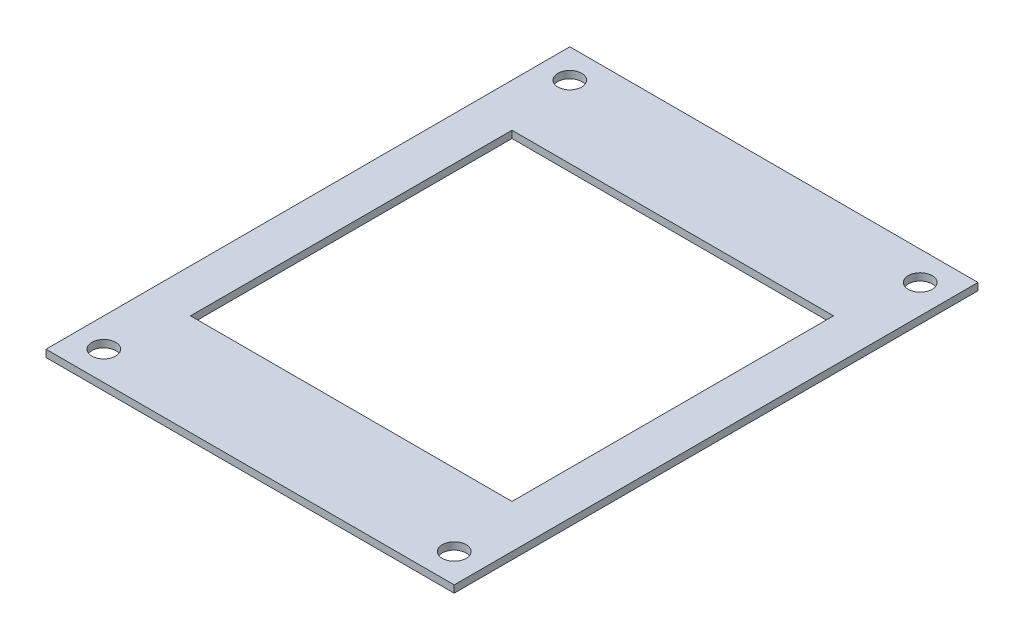
ISO-10303-21;
HEADER;
FILE_DESCRIPTION(('STEP AP214'),'2;1');
FILE_NAME('part.step','',(''),(''),'','','');
FILE_SCHEMA(('AUTOMOTIVE_DESIGN { 1 0 10303 214 1 1 1 1 }'));
ENDSEC;
DATA;
#1=APPLICATION_CONTEXT('core data for automotive mechanical design processes');
#2=APPLICATION_PROTOCOL_DEFINITION('international standard','automotive_design',2000,#1);
#3=PRODUCT_CONTEXT('',#1,'mechanical');
#4=PRODUCT('Part','Part','',(#3));
#5=PRODUCT_RELATED_PRODUCT_CATEGORY('part','',(#4));
#6=PRODUCT_DEFINITION_FORMATION('','',#4);
#7=PRODUCT_DEFINITION_CONTEXT('part definition',#1,'design');
#8=PRODUCT_DEFINITION('design','',#6,#7);
#9=PRODUCT_DEFINITION_SHAPE('','',#8);
#10=(LENGTH_UNIT() NAMED_UNIT(*) SI_UNIT(.MILLI.,.METRE.));
#11=(NAMED_UNIT(*) PLANE_ANGLE_UNIT() SI_UNIT($,.RADIAN.));
#12=(NAMED_UNIT(*) SI_UNIT($,.STERADIAN.) SOLID_ANGLE_UNIT());
#13=UNCERTAINTY_MEASURE_WITH_UNIT(LENGTH_MEASURE(1.E-05),#10,'distance_accuracy_value','');
#14=(GEOMETRIC_REPRESENTATION_CONTEXT(3) GLOBAL_UNCERTAINTY_ASSIGNED_CONTEXT((#13)) GLOBAL_UNIT_ASSIGNED_CONTEXT((#10,
#11,#12)) REPRESENTATION_CONTEXT('',''));
#15=CARTESIAN_POINT('',(0.,0.,0.));
#16=DIRECTION('',(0.,0.,1.));
#17=DIRECTION('',(1.,0.,0.));
#18=AXIS2_PLACEMENT_3D('',#15,#16,#17);
#19=CARTESIAN_POINT('',(0.,1.,0.));
#20=DIRECTION('',(0.,1.,0.));
#21=DIRECTION('',(0.,0.,1.));
#22=AXIS2_PLACEMENT_3D('',#19,#20,#21);
#23=PLANE('',#22);
#24=CARTESIAN_POINT('',(24.25,1.,32.25));
#25=DIRECTION('',(0.,1.,0.));
#26=DIRECTION('',(0.,0.,1.));
#27=AXIS2_PLACEMENT_3D('',#24,#25,#26);
#28=CIRCLE('',#27,1.65);
#29=CARTESIAN_POINT('',(24.25,1.,33.9));
#30=VERTEX_POINT('',#29);
#31=EDGE_CURVE('E253',#30,#30,#28,.T.);
#32=ORIENTED_EDGE('',*,*,#31,.F.);
#33=EDGE_LOOP('',(#32));
#34=FACE_BOUND('',#33,.T.);
#35=CARTESIAN_POINT('',(-24.25,1.,-32.25));
#36=DIRECTION('',(0.,1.,0.));
#37=DIRECTION('',(0.,0.,1.));
#38=AXIS2_PLACEMENT_3D('',#35,#36,#37);
#39=CIRCLE('',#38,1.65);
#40=CARTESIAN_POINT('',(-24.25,1.,-30.6));
#41=VERTEX_POINT('',#40);
#42=EDGE_CURVE('E135',#41,#41,#39,.T.);
#43=ORIENTED_EDGE('',*,*,#42,.F.);
#44=EDGE_LOOP('',(#43));
#45=FACE_BOUND('',#44,.T.);
#46=DIRECTION('',(0.,0.,1.));
#47=VECTOR('',#46,1.);
#48=CARTESIAN_POINT('',(-28.25,1.,-36.25));
#49=LINE('',#48,#47);
#50=CARTESIAN_POINT('',(-28.25,1.,-36.25));
#51=VERTEX_POINT('',#50);
#52=CARTESIAN_POINT('',(-28.25,1.,36.25));
#53=VERTEX_POINT('',#52);
#54=EDGE_CURVE('E145',#51,#53,#49,.T.);
#55=ORIENTED_EDGE('',*,*,#54,.T.);
#56=DIRECTION('',(1.,0.,0.));
#57=VECTOR('',#56,1.);
#58=CARTESIAN_POINT('',(-28.25,1.,36.25));
#59=LINE('',#58,#57);
#60=CARTESIAN_POINT('',(28.25,1.,36.25));
#61=VERTEX_POINT('',#60);
#62=EDGE_CURVE('E148',#53,#61,#59,.T.);
#63=ORIENTED_EDGE('',*,*,#62,.T.);
#64=DIRECTION('',(0.,0.,-1.));
#65=VECTOR('',#64,1.);
#66=CARTESIAN_POINT('',(28.25,1.,36.25));
#67=LINE('',#66,#65);
#68=CARTESIAN_POINT('',(28.25,1.,-36.25));
#69=VERTEX_POINT('',#68);
#70=EDGE_CURVE('E151',#61,#69,#67,.T.);
#71=ORIENTED_EDGE('',*,*,#70,.T.);
#72=DIRECTION('',(-1.,0.,0.));
#73=VECTOR('',#72,1.);
#74=CARTESIAN_POINT('',(28.25,1.,-36.25));
#75=LINE('',#74,#73);
#76=EDGE_CURVE('E153',#69,#51,#75,.T.);
#77=ORIENTED_EDGE('',*,*,#76,.T.);
#78=EDGE_LOOP('',(#55,#63,#71,#77));
#79=FACE_BOUND('',#78,.T.);
#80=DIRECTION('',(-1.,0.,0.));
#81=VECTOR('',#80,1.);
#82=CARTESIAN_POINT('',(-22.25,1.,-22.25));
#83=LINE('',#82,#81);
#84=CARTESIAN_POINT('',(22.25,1.,-22.25));
#85=VERTEX_POINT('',#84);
#86=CARTESIAN_POINT('',(-22.25,1.,-22.25));
#87=VERTEX_POINT('',#86);
#88=EDGE_CURVE('E114',#85,#87,#83,.T.);
#89=ORIENTED_EDGE('',*,*,#88,.F.);
#90=DIRECTION('',(0.,0.,-1.));
#91=VECTOR('',#90,1.);
#92=CARTESIAN_POINT('',(22.25,1.,-22.25));
#93=LINE('',#92,#91);
#94=CARTESIAN_POINT('',(22.25,1.,22.25));
#95=VERTEX_POINT('',#94);
#96=EDGE_CURVE('E106',#95,#85,#93,.T.);
#97=ORIENTED_EDGE('',*,*,#96,.F.);
#98=DIRECTION('',(1.,0.,0.));
#99=VECTOR('',#98,1.);
#100=CARTESIAN_POINT('',(-22.25,1.,22.25));
#101=LINE('',#100,#99);
#102=CARTESIAN_POINT('',(-22.25,1.,22.25));
#103=VERTEX_POINT('',#102);
#104=EDGE_CURVE('E129',#103,#95,#101,.T.);
#105=ORIENTED_EDGE('',*,*,#104,.F.);
#106=DIRECTION('',(0.,0.,1.));
#107=VECTOR('',#106,1.);
#108=CARTESIAN_POINT('',(-22.25,1.,-22.25));
#109=LINE('',#108,#107);
#110=EDGE_CURVE('E127',#87,#103,#109,.T.);
#111=ORIENTED_EDGE('',*,*,#110,.F.);
#112=EDGE_LOOP('',(#89,#97,#105,#111));
#113=FACE_BOUND('',#112,.T.);
#114=CARTESIAN_POINT('',(24.25,1.,-32.25));
#115=DIRECTION('',(0.,1.,0.));
#116=DIRECTION('',(0.,0.,1.));
#117=AXIS2_PLACEMENT_3D('',#114,#115,#116);
#118=CIRCLE('',#117,1.65);
#119=CARTESIAN_POINT('',(24.25,1.,-30.6));
#120=VERTEX_POINT('',#119);
#121=EDGE_CURVE('E259',#120,#120,#118,.T.);
#122=ORIENTED_EDGE('',*,*,#121,.F.);
#123=EDGE_LOOP('',(#122));
#124=FACE_BOUND('',#123,.T.);
#125=CARTESIAN_POINT('',(-24.25,1.,32.25));
#126=DIRECTION('',(0.,1.,0.));
#127=DIRECTION('',(0.,0.,1.));
#128=AXIS2_PLACEMENT_3D('',#125,#126,#127);
#129=CIRCLE('',#128,1.65);
#130=CARTESIAN_POINT('',(-24.25,1.,33.9));
#131=VERTEX_POINT('',#130);
#132=EDGE_CURVE('E244',#131,#131,#129,.T.);
#133=ORIENTED_EDGE('',*,*,#132,.F.);
#134=EDGE_LOOP('',(#133));
#135=FACE_BOUND('',#134,.T.);
#136=ADVANCED_FACE('F41',(#34,#45,#79,#113,#124,#135),#23,.T.);
#137=CARTESIAN_POINT('',(0.,0.,0.));
#138=DIRECTION('',(0.,1.,0.));
#139=DIRECTION('',(0.,0.,1.));
#140=AXIS2_PLACEMENT_3D('',#137,#138,#139);
#141=PLANE('',#140);
#142=DIRECTION('',(0.,0.,1.));
#143=VECTOR('',#142,1.);
#144=CARTESIAN_POINT('',(-28.25,0.,-36.25));
#145=LINE('',#144,#143);
#146=CARTESIAN_POINT('',(-28.25,0.,-36.25));
#147=VERTEX_POINT('',#146);
#148=CARTESIAN_POINT('',(-28.25,0.,36.25));
#149=VERTEX_POINT('',#148);
#150=EDGE_CURVE('E122',#147,#149,#145,.T.);
#151=ORIENTED_EDGE('',*,*,#150,.F.);
#152=DIRECTION('',(-1.,0.,0.));
#153=VECTOR('',#152,1.);
#154=CARTESIAN_POINT('',(28.25,0.,-36.25));
#155=LINE('',#154,#153);
#156=CARTESIAN_POINT('',(28.25,0.,-36.25));
#157=VERTEX_POINT('',#156);
#158=EDGE_CURVE('E149',#157,#147,#155,.T.);
#159=ORIENTED_EDGE('',*,*,#158,.F.);
#160=DIRECTION('',(0.,0.,-1.));
#161=VECTOR('',#160,1.);
#162=CARTESIAN_POINT('',(28.25,0.,36.25));
#163=LINE('',#162,#161);
#164=CARTESIAN_POINT('',(28.25,0.,36.25));
#165=VERTEX_POINT('',#164);
#166=EDGE_CURVE('E160',#165,#157,#163,.T.);
#167=ORIENTED_EDGE('',*,*,#166,.F.);
#168=DIRECTION('',(1.,0.,0.));
#169=VECTOR('',#168,1.);
#170=CARTESIAN_POINT('',(-28.25,0.,36.25));
#171=LINE('',#170,#169);
#172=EDGE_CURVE('E158',#149,#165,#171,.T.);
#173=ORIENTED_EDGE('',*,*,#172,.F.);
#174=EDGE_LOOP('',(#151,#159,#167,#173));
#175=FACE_BOUND('',#174,.T.);
#176=DIRECTION('',(0.,0.,-1.));
#177=VECTOR('',#176,1.);
#178=CARTESIAN_POINT('',(22.25,0.,-22.25));
#179=LINE('',#178,#177);
#180=CARTESIAN_POINT('',(22.25,0.,22.25));
#181=VERTEX_POINT('',#180);
#182=CARTESIAN_POINT('',(22.25,0.,-22.25));
#183=VERTEX_POINT('',#182);
#184=EDGE_CURVE('E64',#181,#183,#179,.T.);
#185=ORIENTED_EDGE('',*,*,#184,.T.);
#186=DIRECTION('',(-1.,0.,0.));
#187=VECTOR('',#186,1.);
#188=CARTESIAN_POINT('',(-22.25,0.,-22.25));
#189=LINE('',#188,#187);
#190=CARTESIAN_POINT('',(-22.25,0.,-22.25));
#191=VERTEX_POINT('',#190);
#192=EDGE_CURVE('E121',#183,#191,#189,.T.);
#193=ORIENTED_EDGE('',*,*,#192,.T.);
#194=DIRECTION('',(0.,0.,1.));
#195=VECTOR('',#194,1.);
#196=CARTESIAN_POINT('',(-22.25,0.,-22.25));
#197=LINE('',#196,#195);
#198=CARTESIAN_POINT('',(-22.25,0.,22.25));
#199=VERTEX_POINT('',#198);
#200=EDGE_CURVE('E137',#191,#199,#197,.T.);
#201=ORIENTED_EDGE('',*,*,#200,.T.);
#202=DIRECTION('',(1.,0.,0.));
#203=VECTOR('',#202,1.);
#204=CARTESIAN_POINT('',(-22.25,0.,22.25));
#205=LINE('',#204,#203);
#206=EDGE_CURVE('E115',#199,#181,#205,.T.);
#207=ORIENTED_EDGE('',*,*,#206,.T.);
#208=EDGE_LOOP('',(#185,#193,#201,#207));
#209=FACE_BOUND('',#208,.T.);
#210=CARTESIAN_POINT('',(-24.25,0.,-32.25));
#211=DIRECTION('',(0.,1.,0.));
#212=DIRECTION('',(0.,0.,1.));
#213=AXIS2_PLACEMENT_3D('',#210,#211,#212);
#214=CIRCLE('',#213,1.65);
#215=CARTESIAN_POINT('',(-24.25,0.,-30.6));
#216=VERTEX_POINT('',#215);
#217=EDGE_CURVE('E262',#216,#216,#214,.T.);
#218=ORIENTED_EDGE('',*,*,#217,.T.);
#219=EDGE_LOOP('',(#218));
#220=FACE_BOUND('',#219,.T.);
#221=CARTESIAN_POINT('',(24.25,0.,-32.25));
#222=DIRECTION('',(0.,1.,0.));
#223=DIRECTION('',(0.,0.,1.));
#224=AXIS2_PLACEMENT_3D('',#221,#222,#223);
#225=CIRCLE('',#224,1.65);
#226=CARTESIAN_POINT('',(24.25,0.,-30.6));
#227=VERTEX_POINT('',#226);
#228=EDGE_CURVE('E256',#227,#227,#225,.T.);
#229=ORIENTED_EDGE('',*,*,#228,.T.);
#230=EDGE_LOOP('',(#229));
#231=FACE_BOUND('',#230,.T.);
#232=CARTESIAN_POINT('',(24.25,0.,32.25));
#233=DIRECTION('',(0.,1.,0.));
#234=DIRECTION('',(0.,0.,1.));
#235=AXIS2_PLACEMENT_3D('',#232,#233,#234);
#236=CIRCLE('',#235,1.65);
#237=CARTESIAN_POINT('',(24.25,0.,33.9));
#238=VERTEX_POINT('',#237);
#239=EDGE_CURVE('E250',#238,#238,#236,.T.);
#240=ORIENTED_EDGE('',*,*,#239,.T.);
#241=EDGE_LOOP('',(#240));
#242=FACE_BOUND('',#241,.T.);
#243=CARTESIAN_POINT('',(-24.25,0.,32.25));
#244=DIRECTION('',(0.,1.,0.));
#245=DIRECTION('',(0.,0.,1.));
#246=AXIS2_PLACEMENT_3D('',#243,#244,#245);
#247=CIRCLE('',#246,1.65);
#248=CARTESIAN_POINT('',(-24.25,0.,33.9));
#249=VERTEX_POINT('',#248);
#250=EDGE_CURVE('E247',#249,#249,#247,.T.);
#251=ORIENTED_EDGE('',*,*,#250,.T.);
#252=EDGE_LOOP('',(#251));
#253=FACE_BOUND('',#252,.T.);
#254=ADVANCED_FACE('F178',(#175,#209,#220,#231,#242,#253),#141,.F.);
#255=CARTESIAN_POINT('',(-28.25,1.,-36.25));
#256=DIRECTION('',(1.,0.,0.));
#257=DIRECTION('',(0.,0.,-1.));
#258=AXIS2_PLACEMENT_3D('',#255,#256,#257);
#259=PLANE('',#258);
#260=ORIENTED_EDGE('',*,*,#150,.T.);
#261=DIRECTION('',(0.,-1.,0.));
#262=VECTOR('',#261,1.);
#263=CARTESIAN_POINT('',(-28.25,1.,36.25));
#264=LINE('',#263,#262);
#265=EDGE_CURVE('E11',#53,#149,#264,.T.);
#266=ORIENTED_EDGE('',*,*,#265,.F.);
#267=ORIENTED_EDGE('',*,*,#54,.F.);
#268=DIRECTION('',(0.,-1.,0.));
#269=VECTOR('',#268,1.);
#270=CARTESIAN_POINT('',(-28.25,1.,-36.25));
#271=LINE('',#270,#269);
#272=EDGE_CURVE('E155',#51,#147,#271,.T.);
#273=ORIENTED_EDGE('',*,*,#272,.T.);
#274=EDGE_LOOP('',(#260,#266,#267,#273));
#275=FACE_BOUND('',#274,.T.);
#276=ADVANCED_FACE('F43',(#275),#259,.F.);
#277=CARTESIAN_POINT('',(-28.25,1.,36.25));
#278=DIRECTION('',(0.,0.,-1.));
#279=DIRECTION('',(-1.,0.,0.));
#280=AXIS2_PLACEMENT_3D('',#277,#278,#279);
#281=PLANE('',#280);
#282=ORIENTED_EDGE('',*,*,#172,.T.);
#283=DIRECTION('',(0.,-1.,0.));
#284=VECTOR('',#283,1.);
#285=CARTESIAN_POINT('',(28.25,1.,36.25));
#286=LINE('',#285,#284);
#287=EDGE_CURVE('E49',#61,#165,#286,.T.);
#288=ORIENTED_EDGE('',*,*,#287,.F.);
#289=ORIENTED_EDGE('',*,*,#62,.F.);
#290=ORIENTED_EDGE('',*,*,#265,.T.);
#291=EDGE_LOOP('',(#282,#288,#289,#290));
#292=FACE_BOUND('',#291,.T.);
#293=ADVANCED_FACE('F188',(#292),#281,.F.);
#294=CARTESIAN_POINT('',(28.25,1.,36.25));
#295=DIRECTION('',(-1.,0.,0.));
#296=DIRECTION('',(0.,0.,1.));
#297=AXIS2_PLACEMENT_3D('',#294,#295,#296);
#298=PLANE('',#297);
#299=ORIENTED_EDGE('',*,*,#166,.T.);
#300=DIRECTION('',(0.,-1.,0.));
#301=VECTOR('',#300,1.);
#302=CARTESIAN_POINT('',(28.25,1.,-36.25));
#303=LINE('',#302,#301);
#304=EDGE_CURVE('E165',#69,#157,#303,.T.);
#305=ORIENTED_EDGE('',*,*,#304,.F.);
#306=ORIENTED_EDGE('',*,*,#70,.F.);
#307=ORIENTED_EDGE('',*,*,#287,.T.);
#308=EDGE_LOOP('',(#299,#305,#306,#307));
#309=FACE_BOUND('',#308,.T.);
#310=ADVANCED_FACE('F172',(#309),#298,.F.);
#311=CARTESIAN_POINT('',(28.25,1.,-36.25));
#312=DIRECTION('',(0.,0.,1.));
#313=DIRECTION('',(1.,0.,0.));
#314=AXIS2_PLACEMENT_3D('',#311,#312,#313);
#315=PLANE('',#314);
#316=ORIENTED_EDGE('',*,*,#158,.T.);
#317=ORIENTED_EDGE('',*,*,#272,.F.);
#318=ORIENTED_EDGE('',*,*,#76,.F.);
#319=ORIENTED_EDGE('',*,*,#304,.T.);
#320=EDGE_LOOP('',(#316,#317,#318,#319));
#321=FACE_BOUND('',#320,.T.);
#322=ADVANCED_FACE('F182',(#321),#315,.F.);
#323=CARTESIAN_POINT('',(22.25,1.,-22.25));
#324=DIRECTION('',(-1.,0.,0.));
#325=DIRECTION('',(0.,0.,1.));
#326=AXIS2_PLACEMENT_3D('',#323,#324,#325);
#327=PLANE('',#326);
#328=ORIENTED_EDGE('',*,*,#184,.F.);
#329=DIRECTION('',(0.,-1.,0.));
#330=VECTOR('',#329,1.);
#331=CARTESIAN_POINT('',(22.25,1.,22.25));
#332=LINE('',#331,#330);
#333=EDGE_CURVE('E110',#95,#181,#332,.T.);
#334=ORIENTED_EDGE('',*,*,#333,.F.);
#335=ORIENTED_EDGE('',*,*,#96,.T.);
#336=DIRECTION('',(0.,-1.,0.));
#337=VECTOR('',#336,1.);
#338=CARTESIAN_POINT('',(22.25,1.,-22.25));
#339=LINE('',#338,#337);
#340=EDGE_CURVE('E109',#85,#183,#339,.T.);
#341=ORIENTED_EDGE('',*,*,#340,.T.);
#342=EDGE_LOOP('',(#328,#334,#335,#341));
#343=FACE_BOUND('',#342,.T.);
#344=ADVANCED_FACE('F108',(#343),#327,.T.);
#345=CARTESIAN_POINT('',(-22.25,1.,-22.25));
#346=DIRECTION('',(0.,0.,1.));
#347=DIRECTION('',(1.,0.,0.));
#348=AXIS2_PLACEMENT_3D('',#345,#346,#347);
#349=PLANE('',#348);
#350=ORIENTED_EDGE('',*,*,#192,.F.);
#351=ORIENTED_EDGE('',*,*,#340,.F.);
#352=ORIENTED_EDGE('',*,*,#88,.T.);
#353=DIRECTION('',(0.,-1.,0.));
#354=VECTOR('',#353,1.);
#355=CARTESIAN_POINT('',(-22.25,1.,-22.25));
#356=LINE('',#355,#354);
#357=EDGE_CURVE('E123',#87,#191,#356,.T.);
#358=ORIENTED_EDGE('',*,*,#357,.T.);
#359=EDGE_LOOP('',(#350,#351,#352,#358));
#360=FACE_BOUND('',#359,.T.);
#361=ADVANCED_FACE('F118',(#360),#349,.T.);
#362=CARTESIAN_POINT('',(-22.25,1.,-22.25));
#363=DIRECTION('',(1.,0.,0.));
#364=DIRECTION('',(0.,0.,-1.));
#365=AXIS2_PLACEMENT_3D('',#362,#363,#364);
#366=PLANE('',#365);
#367=ORIENTED_EDGE('',*,*,#200,.F.);
#368=ORIENTED_EDGE('',*,*,#357,.F.);
#369=ORIENTED_EDGE('',*,*,#110,.T.);
#370=DIRECTION('',(0.,-1.,0.));
#371=VECTOR('',#370,1.);
#372=CARTESIAN_POINT('',(-22.25,1.,22.25));
#373=LINE('',#372,#371);
#374=EDGE_CURVE('E56',#103,#199,#373,.T.);
#375=ORIENTED_EDGE('',*,*,#374,.T.);
#376=EDGE_LOOP('',(#367,#368,#369,#375));
#377=FACE_BOUND('',#376,.T.);
#378=ADVANCED_FACE('F214',(#377),#366,.T.);
#379=CARTESIAN_POINT('',(-22.25,1.,22.25));
#380=DIRECTION('',(0.,0.,-1.));
#381=DIRECTION('',(-1.,0.,0.));
#382=AXIS2_PLACEMENT_3D('',#379,#380,#381);
#383=PLANE('',#382);
#384=ORIENTED_EDGE('',*,*,#206,.F.);
#385=ORIENTED_EDGE('',*,*,#374,.F.);
#386=ORIENTED_EDGE('',*,*,#104,.T.);
#387=ORIENTED_EDGE('',*,*,#333,.T.);
#388=EDGE_LOOP('',(#384,#385,#386,#387));
#389=FACE_BOUND('',#388,.T.);
#390=ADVANCED_FACE('F218',(#389),#383,.T.);
#391=CARTESIAN_POINT('',(-24.25,1.,-32.25));
#392=DIRECTION('',(0.,-1.,0.));
#393=DIRECTION('',(0.,0.,-1.));
#394=AXIS2_PLACEMENT_3D('',#391,#392,#393);
#395=CYLINDRICAL_SURFACE('',#394,1.65);
#396=ORIENTED_EDGE('',*,*,#42,.T.);
#397=EDGE_LOOP('',(#396));
#398=FACE_BOUND('',#397,.T.);
#399=ORIENTED_EDGE('',*,*,#217,.F.);
#400=EDGE_LOOP('',(#399));
#401=FACE_BOUND('',#400,.T.);
#402=ADVANCED_FACE('F224',(#398,#401),#395,.F.);
#403=CARTESIAN_POINT('',(24.25,1.,-32.25));
#404=DIRECTION('',(0.,-1.,0.));
#405=DIRECTION('',(0.,0.,-1.));
#406=AXIS2_PLACEMENT_3D('',#403,#404,#405);
#407=CYLINDRICAL_SURFACE('',#406,1.65);
#408=ORIENTED_EDGE('',*,*,#121,.T.);
#409=EDGE_LOOP('',(#408));
#410=FACE_BOUND('',#409,.T.);
#411=ORIENTED_EDGE('',*,*,#228,.F.);
#412=EDGE_LOOP('',(#411));
#413=FACE_BOUND('',#412,.T.);
#414=ADVANCED_FACE('F227',(#410,#413),#407,.F.);
#415=CARTESIAN_POINT('',(24.25,1.,32.25));
#416=DIRECTION('',(0.,-1.,0.));
#417=DIRECTION('',(0.,0.,-1.));
#418=AXIS2_PLACEMENT_3D('',#415,#416,#417);
#419=CYLINDRICAL_SURFACE('',#418,1.65);
#420=ORIENTED_EDGE('',*,*,#31,.T.);
#421=EDGE_LOOP('',(#420));
#422=FACE_BOUND('',#421,.T.);
#423=ORIENTED_EDGE('',*,*,#239,.F.);
#424=EDGE_LOOP('',(#423));
#425=FACE_BOUND('',#424,.T.);
#426=ADVANCED_FACE('F231',(#422,#425),#419,.F.);
#427=CARTESIAN_POINT('',(-24.25,1.,32.25));
#428=DIRECTION('',(0.,-1.,0.));
#429=DIRECTION('',(0.,0.,-1.));
#430=AXIS2_PLACEMENT_3D('',#427,#428,#429);
#431=CYLINDRICAL_SURFACE('',#430,1.65);
#432=ORIENTED_EDGE('',*,*,#132,.T.);
#433=EDGE_LOOP('',(#432));
#434=FACE_BOUND('',#433,.T.);
#435=ORIENTED_EDGE('',*,*,#250,.F.);
#436=EDGE_LOOP('',(#435));
#437=FACE_BOUND('',#436,.T.);
#438=ADVANCED_FACE('F235',(#434,#437),#431,.F.);
#439=CLOSED_SHELL('',(#136,#254,#276,#293,#310,#322,#344,#361,#378,#390,#402,#414,#426,#438));
#440=MANIFOLD_SOLID_BREP('B2',#439);
#441=ADVANCED_BREP_SHAPE_REPRESENTATION('',(#18,#440),#14);
#442=SHAPE_DEFINITION_REPRESENTATION(#9,#441);
ENDSEC;
END-ISO-10303-21;
